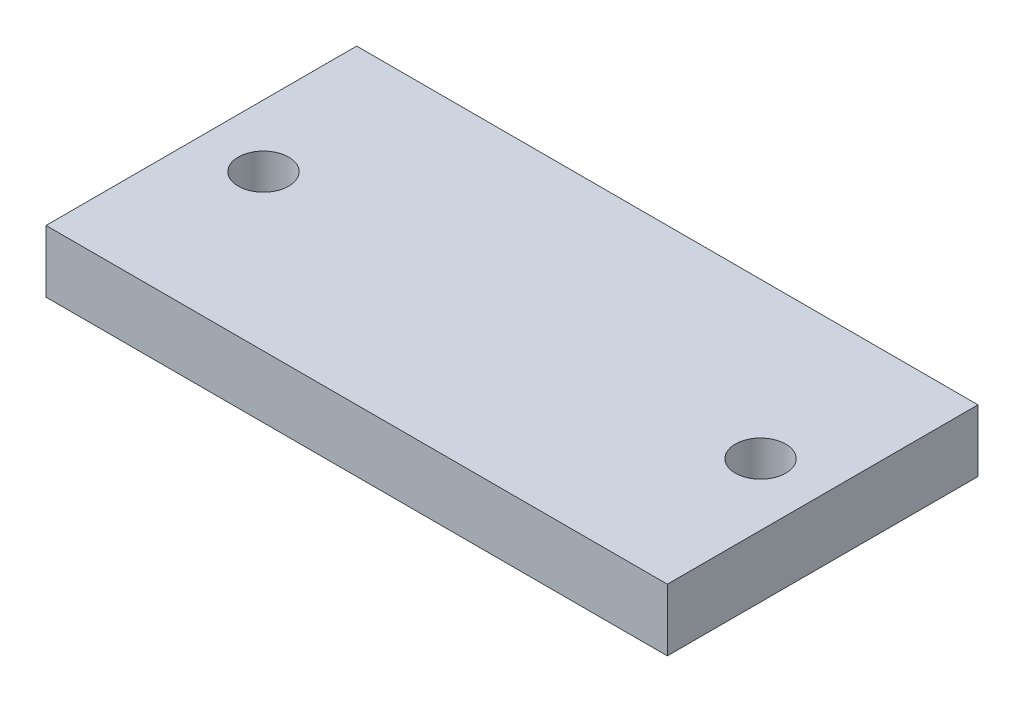
ISO-10303-21;
HEADER;
FILE_DESCRIPTION(('STEP AP214'),'2;1');
FILE_NAME('part.step','',(''),(''),'','','');
FILE_SCHEMA(('AUTOMOTIVE_DESIGN { 1 0 10303 214 1 1 1 1 }'));
ENDSEC;
DATA;
#1=APPLICATION_CONTEXT('core data for automotive mechanical design processes');
#2=APPLICATION_PROTOCOL_DEFINITION('international standard','automotive_design',2000,#1);
#3=PRODUCT_CONTEXT('',#1,'mechanical');
#4=PRODUCT('Part','Part','',(#3));
#5=PRODUCT_RELATED_PRODUCT_CATEGORY('part','',(#4));
#6=PRODUCT_DEFINITION_FORMATION('','',#4);
#7=PRODUCT_DEFINITION_CONTEXT('part definition',#1,'design');
#8=PRODUCT_DEFINITION('design','',#6,#7);
#9=PRODUCT_DEFINITION_SHAPE('','',#8);
#10=(LENGTH_UNIT() NAMED_UNIT(*) SI_UNIT(.MILLI.,.METRE.));
#11=(NAMED_UNIT(*) PLANE_ANGLE_UNIT() SI_UNIT($,.RADIAN.));
#12=(NAMED_UNIT(*) SI_UNIT($,.STERADIAN.) SOLID_ANGLE_UNIT());
#13=UNCERTAINTY_MEASURE_WITH_UNIT(LENGTH_MEASURE(1.E-05),#10,'distance_accuracy_value','');
#14=(GEOMETRIC_REPRESENTATION_CONTEXT(3) GLOBAL_UNCERTAINTY_ASSIGNED_CONTEXT((#13)) GLOBAL_UNIT_ASSIGNED_CONTEXT((#10,
#11,#12)) REPRESENTATION_CONTEXT('',''));
#15=CARTESIAN_POINT('',(0.,0.,0.));
#16=DIRECTION('',(0.,0.,1.));
#17=DIRECTION('',(1.,0.,0.));
#18=AXIS2_PLACEMENT_3D('',#15,#16,#17);
#19=CARTESIAN_POINT('',(0.,25.4,-127.));
#20=DIRECTION('',(0.,-1.,0.));
#21=DIRECTION('',(0.,0.,-1.));
#22=AXIS2_PLACEMENT_3D('',#19,#20,#21);
#23=PLANE('',#22);
#24=CARTESIAN_POINT('',(25.4,25.4,-63.5));
#25=DIRECTION('',(0.,1.,0.));
#26=DIRECTION('',(0.,0.,1.));
#27=AXIS2_PLACEMENT_3D('',#24,#25,#26);
#28=CIRCLE('',#27,10.31875);
#29=CARTESIAN_POINT('',(25.4,25.4,-53.18125));
#30=VERTEX_POINT('',#29);
#31=EDGE_CURVE('E101',#30,#30,#28,.T.);
#32=ORIENTED_EDGE('',*,*,#31,.F.);
#33=EDGE_LOOP('',(#32));
#34=FACE_BOUND('',#33,.T.);
#35=DIRECTION('',(0.,0.,1.));
#36=VECTOR('',#35,1.);
#37=CARTESIAN_POINT('',(0.,25.4,0.));
#38=LINE('',#37,#36);
#39=CARTESIAN_POINT('',(0.,25.4,-127.));
#40=VERTEX_POINT('',#39);
#41=CARTESIAN_POINT('',(0.,25.4,0.));
#42=VERTEX_POINT('',#41);
#43=EDGE_CURVE('E86',#40,#42,#38,.T.);
#44=ORIENTED_EDGE('',*,*,#43,.T.);
#45=DIRECTION('',(1.,0.,0.));
#46=VECTOR('',#45,1.);
#47=CARTESIAN_POINT('',(0.,25.4,0.));
#48=LINE('',#47,#46);
#49=CARTESIAN_POINT('',(254.,25.4,0.));
#50=VERTEX_POINT('',#49);
#51=EDGE_CURVE('E81',#42,#50,#48,.T.);
#52=ORIENTED_EDGE('',*,*,#51,.T.);
#53=DIRECTION('',(0.,0.,-1.));
#54=VECTOR('',#53,1.);
#55=CARTESIAN_POINT('',(254.,25.4,0.));
#56=LINE('',#55,#54);
#57=CARTESIAN_POINT('',(254.,25.4,-127.));
#58=VERTEX_POINT('',#57);
#59=EDGE_CURVE('E84',#50,#58,#56,.T.);
#60=ORIENTED_EDGE('',*,*,#59,.T.);
#61=DIRECTION('',(-1.,0.,0.));
#62=VECTOR('',#61,1.);
#63=CARTESIAN_POINT('',(0.,25.4,-127.));
#64=LINE('',#63,#62);
#65=EDGE_CURVE('E51',#58,#40,#64,.T.);
#66=ORIENTED_EDGE('',*,*,#65,.T.);
#67=EDGE_LOOP('',(#44,#52,#60,#66));
#68=FACE_BOUND('',#67,.T.);
#69=CARTESIAN_POINT('',(228.6,25.4,-63.5));
#70=DIRECTION('',(0.,1.,0.));
#71=DIRECTION('',(0.,0.,1.));
#72=AXIS2_PLACEMENT_3D('',#69,#70,#71);
#73=CIRCLE('',#72,10.31875);
#74=CARTESIAN_POINT('',(228.6,25.4,-53.18125));
#75=VERTEX_POINT('',#74);
#76=EDGE_CURVE('E116',#75,#75,#73,.T.);
#77=ORIENTED_EDGE('',*,*,#76,.F.);
#78=EDGE_LOOP('',(#77));
#79=FACE_BOUND('',#78,.T.);
#80=ADVANCED_FACE('F34',(#34,#68,#79),#23,.F.);
#81=CARTESIAN_POINT('',(0.,0.,-127.));
#82=DIRECTION('',(0.,-1.,0.));
#83=DIRECTION('',(0.,0.,-1.));
#84=AXIS2_PLACEMENT_3D('',#81,#82,#83);
#85=PLANE('',#84);
#86=CARTESIAN_POINT('',(25.4,0.,-63.5));
#87=DIRECTION('',(0.,1.,0.));
#88=DIRECTION('',(0.,0.,1.));
#89=AXIS2_PLACEMENT_3D('',#86,#87,#88);
#90=CIRCLE('',#89,10.31875);
#91=CARTESIAN_POINT('',(25.4,0.,-53.18125));
#92=VERTEX_POINT('',#91);
#93=EDGE_CURVE('E113',#92,#92,#90,.T.);
#94=ORIENTED_EDGE('',*,*,#93,.T.);
#95=EDGE_LOOP('',(#94));
#96=FACE_BOUND('',#95,.T.);
#97=DIRECTION('',(0.,0.,1.));
#98=VECTOR('',#97,1.);
#99=CARTESIAN_POINT('',(0.,0.,0.));
#100=LINE('',#99,#98);
#101=CARTESIAN_POINT('',(0.,0.,-127.));
#102=VERTEX_POINT('',#101);
#103=CARTESIAN_POINT('',(0.,0.,0.));
#104=VERTEX_POINT('',#103);
#105=EDGE_CURVE('E98',#102,#104,#100,.T.);
#106=ORIENTED_EDGE('',*,*,#105,.F.);
#107=DIRECTION('',(-1.,0.,0.));
#108=VECTOR('',#107,1.);
#109=CARTESIAN_POINT('',(0.,0.,-127.));
#110=LINE('',#109,#108);
#111=CARTESIAN_POINT('',(254.,0.,-127.));
#112=VERTEX_POINT('',#111);
#113=EDGE_CURVE('E74',#112,#102,#110,.T.);
#114=ORIENTED_EDGE('',*,*,#113,.F.);
#115=DIRECTION('',(0.,0.,-1.));
#116=VECTOR('',#115,1.);
#117=CARTESIAN_POINT('',(254.,0.,0.));
#118=LINE('',#117,#116);
#119=CARTESIAN_POINT('',(254.,0.,0.));
#120=VERTEX_POINT('',#119);
#121=EDGE_CURVE('E68',#120,#112,#118,.T.);
#122=ORIENTED_EDGE('',*,*,#121,.F.);
#123=DIRECTION('',(1.,0.,0.));
#124=VECTOR('',#123,1.);
#125=CARTESIAN_POINT('',(0.,0.,0.));
#126=LINE('',#125,#124);
#127=EDGE_CURVE('E90',#104,#120,#126,.T.);
#128=ORIENTED_EDGE('',*,*,#127,.F.);
#129=EDGE_LOOP('',(#106,#114,#122,#128));
#130=FACE_BOUND('',#129,.T.);
#131=CARTESIAN_POINT('',(228.6,0.,-63.5));
#132=DIRECTION('',(0.,1.,0.));
#133=DIRECTION('',(0.,0.,1.));
#134=AXIS2_PLACEMENT_3D('',#131,#132,#133);
#135=CIRCLE('',#134,10.31875);
#136=CARTESIAN_POINT('',(228.6,0.,-53.18125));
#137=VERTEX_POINT('',#136);
#138=EDGE_CURVE('E119',#137,#137,#135,.T.);
#139=ORIENTED_EDGE('',*,*,#138,.T.);
#140=EDGE_LOOP('',(#139));
#141=FACE_BOUND('',#140,.T.);
#142=ADVANCED_FACE('F109',(#96,#130,#141),#85,.T.);
#143=CARTESIAN_POINT('',(0.,25.4,0.));
#144=DIRECTION('',(1.,0.,0.));
#145=DIRECTION('',(0.,0.,-1.));
#146=AXIS2_PLACEMENT_3D('',#143,#144,#145);
#147=PLANE('',#146);
#148=ORIENTED_EDGE('',*,*,#105,.T.);
#149=DIRECTION('',(0.,-1.,0.));
#150=VECTOR('',#149,1.);
#151=CARTESIAN_POINT('',(0.,25.4,0.));
#152=LINE('',#151,#150);
#153=EDGE_CURVE('E11',#42,#104,#152,.T.);
#154=ORIENTED_EDGE('',*,*,#153,.F.);
#155=ORIENTED_EDGE('',*,*,#43,.F.);
#156=DIRECTION('',(0.,-1.,0.));
#157=VECTOR('',#156,1.);
#158=CARTESIAN_POINT('',(0.,25.4,-127.));
#159=LINE('',#158,#157);
#160=EDGE_CURVE('E94',#40,#102,#159,.T.);
#161=ORIENTED_EDGE('',*,*,#160,.T.);
#162=EDGE_LOOP('',(#148,#154,#155,#161));
#163=FACE_BOUND('',#162,.T.);
#164=ADVANCED_FACE('F36',(#163),#147,.F.);
#165=CARTESIAN_POINT('',(0.,25.4,0.));
#166=DIRECTION('',(0.,0.,-1.));
#167=DIRECTION('',(-1.,0.,0.));
#168=AXIS2_PLACEMENT_3D('',#165,#166,#167);
#169=PLANE('',#168);
#170=ORIENTED_EDGE('',*,*,#127,.T.);
#171=DIRECTION('',(0.,-1.,0.));
#172=VECTOR('',#171,1.);
#173=CARTESIAN_POINT('',(254.,25.4,0.));
#174=LINE('',#173,#172);
#175=EDGE_CURVE('E43',#50,#120,#174,.T.);
#176=ORIENTED_EDGE('',*,*,#175,.F.);
#177=ORIENTED_EDGE('',*,*,#51,.F.);
#178=ORIENTED_EDGE('',*,*,#153,.T.);
#179=EDGE_LOOP('',(#170,#176,#177,#178));
#180=FACE_BOUND('',#179,.T.);
#181=ADVANCED_FACE('F89',(#180),#169,.F.);
#182=CARTESIAN_POINT('',(254.,25.4,0.));
#183=DIRECTION('',(-1.,0.,0.));
#184=DIRECTION('',(0.,0.,1.));
#185=AXIS2_PLACEMENT_3D('',#182,#183,#184);
#186=PLANE('',#185);
#187=ORIENTED_EDGE('',*,*,#121,.T.);
#188=DIRECTION('',(0.,-1.,0.));
#189=VECTOR('',#188,1.);
#190=CARTESIAN_POINT('',(254.,25.4,-127.));
#191=LINE('',#190,#189);
#192=EDGE_CURVE('E91',#58,#112,#191,.T.);
#193=ORIENTED_EDGE('',*,*,#192,.F.);
#194=ORIENTED_EDGE('',*,*,#59,.F.);
#195=ORIENTED_EDGE('',*,*,#175,.T.);
#196=EDGE_LOOP('',(#187,#193,#194,#195));
#197=FACE_BOUND('',#196,.T.);
#198=ADVANCED_FACE('F92',(#197),#186,.F.);
#199=CARTESIAN_POINT('',(0.,25.4,-127.));
#200=DIRECTION('',(0.,0.,1.));
#201=DIRECTION('',(1.,0.,0.));
#202=AXIS2_PLACEMENT_3D('',#199,#200,#201);
#203=PLANE('',#202);
#204=ORIENTED_EDGE('',*,*,#113,.T.);
#205=ORIENTED_EDGE('',*,*,#160,.F.);
#206=ORIENTED_EDGE('',*,*,#65,.F.);
#207=ORIENTED_EDGE('',*,*,#192,.T.);
#208=EDGE_LOOP('',(#204,#205,#206,#207));
#209=FACE_BOUND('',#208,.T.);
#210=ADVANCED_FACE('F106',(#209),#203,.F.);
#211=CARTESIAN_POINT('',(25.4,25.4,-63.5));
#212=DIRECTION('',(0.,-1.,0.));
#213=DIRECTION('',(0.,0.,-1.));
#214=AXIS2_PLACEMENT_3D('',#211,#212,#213);
#215=CYLINDRICAL_SURFACE('',#214,10.31875);
#216=ORIENTED_EDGE('',*,*,#31,.T.);
#217=EDGE_LOOP('',(#216));
#218=FACE_BOUND('',#217,.T.);
#219=ORIENTED_EDGE('',*,*,#93,.F.);
#220=EDGE_LOOP('',(#219));
#221=FACE_BOUND('',#220,.T.);
#222=ADVANCED_FACE('F137',(#218,#221),#215,.F.);
#223=CARTESIAN_POINT('',(228.6,25.4,-63.5));
#224=DIRECTION('',(0.,-1.,0.));
#225=DIRECTION('',(0.,0.,-1.));
#226=AXIS2_PLACEMENT_3D('',#223,#224,#225);
#227=CYLINDRICAL_SURFACE('',#226,10.31875);
#228=ORIENTED_EDGE('',*,*,#76,.T.);
#229=EDGE_LOOP('',(#228));
#230=FACE_BOUND('',#229,.T.);
#231=ORIENTED_EDGE('',*,*,#138,.F.);
#232=EDGE_LOOP('',(#231));
#233=FACE_BOUND('',#232,.T.);
#234=ADVANCED_FACE('F125',(#230,#233),#227,.F.);
#235=CLOSED_SHELL('',(#80,#142,#164,#181,#198,#210,#222,#234));
#236=MANIFOLD_SOLID_BREP('B2',#235);
#237=ADVANCED_BREP_SHAPE_REPRESENTATION('',(#18,#236),#14);
#238=SHAPE_DEFINITION_REPRESENTATION(#9,#237);
ENDSEC;
END-ISO-10303-21;
